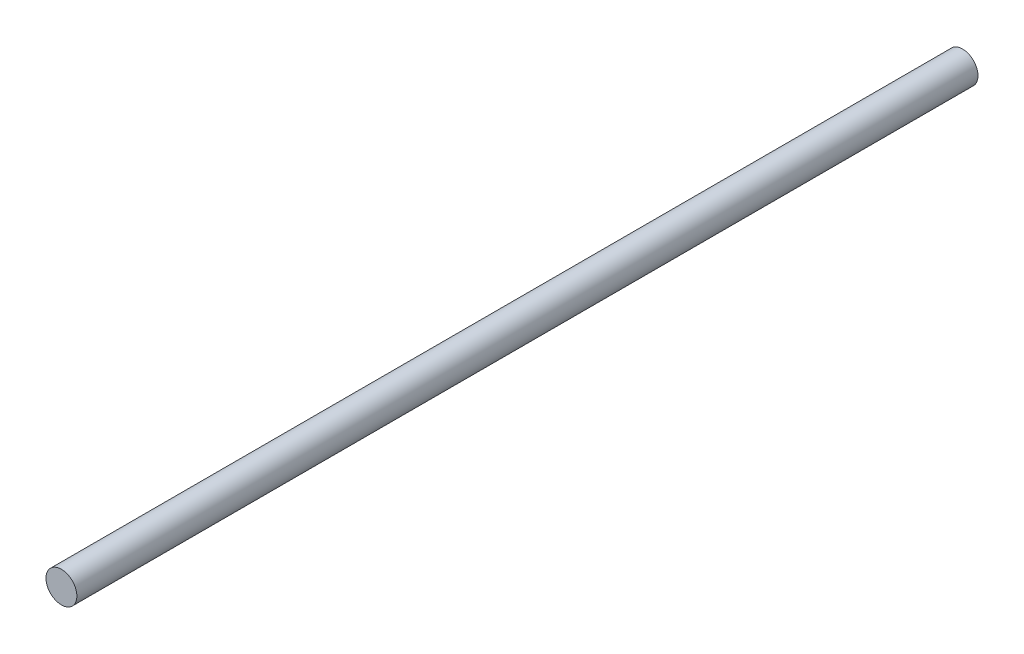
ISO-10303-21;
HEADER;
FILE_DESCRIPTION(('STEP AP214'),'2;1');
FILE_NAME('part.step','',(''),(''),'','','');
FILE_SCHEMA(('AUTOMOTIVE_DESIGN { 1 0 10303 214 1 1 1 1 }'));
ENDSEC;
DATA;
#1=APPLICATION_CONTEXT('core data for automotive mechanical design processes');
#2=APPLICATION_PROTOCOL_DEFINITION('international standard','automotive_design',2000,#1);
#3=PRODUCT_CONTEXT('',#1,'mechanical');
#4=PRODUCT('Part','Part','',(#3));
#5=PRODUCT_RELATED_PRODUCT_CATEGORY('part','',(#4));
#6=PRODUCT_DEFINITION_FORMATION('','',#4);
#7=PRODUCT_DEFINITION_CONTEXT('part definition',#1,'design');
#8=PRODUCT_DEFINITION('design','',#6,#7);
#9=PRODUCT_DEFINITION_SHAPE('','',#8);
#10=(LENGTH_UNIT() NAMED_UNIT(*) SI_UNIT(.MILLI.,.METRE.));
#11=(NAMED_UNIT(*) PLANE_ANGLE_UNIT() SI_UNIT($,.RADIAN.));
#12=(NAMED_UNIT(*) SI_UNIT($,.STERADIAN.) SOLID_ANGLE_UNIT());
#13=UNCERTAINTY_MEASURE_WITH_UNIT(LENGTH_MEASURE(1.E-05),#10,'distance_accuracy_value','');
#14=(GEOMETRIC_REPRESENTATION_CONTEXT(3) GLOBAL_UNCERTAINTY_ASSIGNED_CONTEXT((#13)) GLOBAL_UNIT_ASSIGNED_CONTEXT((#10,
#11,#12)) REPRESENTATION_CONTEXT('',''));
#15=CARTESIAN_POINT('',(0.,0.,0.));
#16=DIRECTION('',(0.,0.,1.));
#17=DIRECTION('',(1.,0.,0.));
#18=AXIS2_PLACEMENT_3D('',#15,#16,#17);
#19=CARTESIAN_POINT('',(0.,0.,350.));
#20=DIRECTION('',(0.,0.,-1.));
#21=DIRECTION('',(-1.,0.,0.));
#22=AXIS2_PLACEMENT_3D('',#19,#20,#21);
#23=CYLINDRICAL_SURFACE('',#22,6.);
#24=CARTESIAN_POINT('',(0.,0.,350.));
#25=DIRECTION('',(0.,0.,1.));
#26=DIRECTION('',(1.,0.,0.));
#27=AXIS2_PLACEMENT_3D('',#24,#25,#26);
#28=CIRCLE('',#27,6.);
#29=CARTESIAN_POINT('',(6.,0.,350.));
#30=VERTEX_POINT('',#29);
#31=EDGE_CURVE('E10',#30,#30,#28,.T.);
#32=ORIENTED_EDGE('',*,*,#31,.F.);
#33=EDGE_LOOP('',(#32));
#34=FACE_BOUND('',#33,.T.);
#35=CARTESIAN_POINT('',(0.,0.,0.));
#36=DIRECTION('',(0.,0.,1.));
#37=DIRECTION('',(1.,0.,0.));
#38=AXIS2_PLACEMENT_3D('',#35,#36,#37);
#39=CIRCLE('',#38,6.);
#40=CARTESIAN_POINT('',(6.,0.,0.));
#41=VERTEX_POINT('',#40);
#42=EDGE_CURVE('E37',#41,#41,#39,.T.);
#43=ORIENTED_EDGE('',*,*,#42,.T.);
#44=EDGE_LOOP('',(#43));
#45=FACE_BOUND('',#44,.T.);
#46=ADVANCED_FACE('F34',(#34,#45),#23,.T.);
#47=CARTESIAN_POINT('',(0.,0.,350.));
#48=DIRECTION('',(0.,0.,1.));
#49=DIRECTION('',(1.,0.,0.));
#50=AXIS2_PLACEMENT_3D('',#47,#48,#49);
#51=PLANE('',#50);
#52=ORIENTED_EDGE('',*,*,#31,.T.);
#53=EDGE_LOOP('',(#52));
#54=FACE_BOUND('',#53,.T.);
#55=ADVANCED_FACE('F50',(#54),#51,.T.);
#56=CARTESIAN_POINT('',(0.,0.,0.));
#57=DIRECTION('',(0.,0.,1.));
#58=DIRECTION('',(1.,0.,0.));
#59=AXIS2_PLACEMENT_3D('',#56,#57,#58);
#60=PLANE('',#59);
#61=ORIENTED_EDGE('',*,*,#42,.F.);
#62=EDGE_LOOP('',(#61));
#63=FACE_BOUND('',#62,.T.);
#64=ADVANCED_FACE('F48',(#63),#60,.F.);
#65=CLOSED_SHELL('',(#46,#55,#64));
#66=MANIFOLD_SOLID_BREP('B2',#65);
#67=ADVANCED_BREP_SHAPE_REPRESENTATION('',(#18,#66),#14);
#68=SHAPE_DEFINITION_REPRESENTATION(#9,#67);
ENDSEC;
END-ISO-10303-21;
